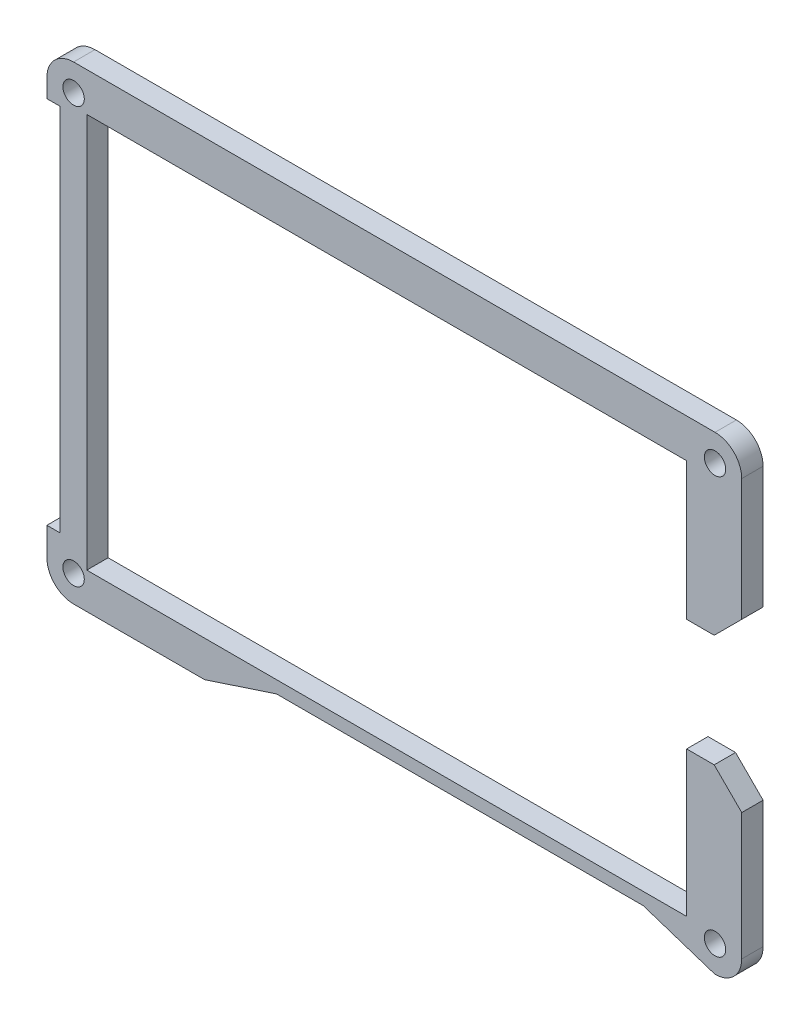
ISO-10303-21;
HEADER;
FILE_DESCRIPTION(('STEP AP214'),'2;1');
FILE_NAME('part.step','',(''),(''),'','','');
FILE_SCHEMA(('AUTOMOTIVE_DESIGN { 1 0 10303 214 1 1 1 1 }'));
ENDSEC;
DATA;
#1=APPLICATION_CONTEXT('core data for automotive mechanical design processes');
#2=APPLICATION_PROTOCOL_DEFINITION('international standard','automotive_design',2000,#1);
#3=PRODUCT_CONTEXT('',#1,'mechanical');
#4=PRODUCT('Part','Part','',(#3));
#5=PRODUCT_RELATED_PRODUCT_CATEGORY('part','',(#4));
#6=PRODUCT_DEFINITION_FORMATION('','',#4);
#7=PRODUCT_DEFINITION_CONTEXT('part definition',#1,'design');
#8=PRODUCT_DEFINITION('design','',#6,#7);
#9=PRODUCT_DEFINITION_SHAPE('','',#8);
#10=(LENGTH_UNIT() NAMED_UNIT(*) SI_UNIT(.MILLI.,.METRE.));
#11=(NAMED_UNIT(*) PLANE_ANGLE_UNIT() SI_UNIT($,.RADIAN.));
#12=(NAMED_UNIT(*) SI_UNIT($,.STERADIAN.) SOLID_ANGLE_UNIT());
#13=UNCERTAINTY_MEASURE_WITH_UNIT(LENGTH_MEASURE(1.E-05),#10,'distance_accuracy_value','');
#14=(GEOMETRIC_REPRESENTATION_CONTEXT(3) GLOBAL_UNCERTAINTY_ASSIGNED_CONTEXT((#13)) GLOBAL_UNIT_ASSIGNED_CONTEXT((#10,
#11,#12)) REPRESENTATION_CONTEXT('',''));
#15=CARTESIAN_POINT('',(0.,0.,0.));
#16=DIRECTION('',(0.,0.,1.));
#17=DIRECTION('',(1.,0.,0.));
#18=AXIS2_PLACEMENT_3D('',#15,#16,#17);
#19=CARTESIAN_POINT('',(-301.9473,0.,3.048));
#20=DIRECTION('',(-1.,0.,0.));
#21=DIRECTION('',(0.,0.,1.));
#22=AXIS2_PLACEMENT_3D('',#19,#20,#21);
#23=PLANE('',#22);
#24=DIRECTION('',(0.,0.,1.));
#25=VECTOR('',#24,1.);
#26=CARTESIAN_POINT('',(-301.9473,133.57775,0.));
#27=LINE('',#26,#25);
#28=CARTESIAN_POINT('',(-301.9473,133.57775,0.));
#29=VERTEX_POINT('',#28);
#30=CARTESIAN_POINT('',(-301.9473,133.57775,3.048));
#31=VERTEX_POINT('',#30);
#32=EDGE_CURVE('E238',#29,#31,#27,.T.);
#33=ORIENTED_EDGE('',*,*,#32,.F.);
#34=DIRECTION('',(0.,1.,0.));
#35=VECTOR('',#34,1.);
#36=CARTESIAN_POINT('',(-301.9473,0.,0.));
#37=LINE('',#36,#35);
#38=CARTESIAN_POINT('',(-301.9473,150.9704,0.));
#39=VERTEX_POINT('',#38);
#40=EDGE_CURVE('E264',#29,#39,#37,.T.);
#41=ORIENTED_EDGE('',*,*,#40,.T.);
#42=DIRECTION('',(0.,0.,-1.));
#43=VECTOR('',#42,1.);
#44=CARTESIAN_POINT('',(-301.9473,150.9704,3.048));
#45=LINE('',#44,#43);
#46=CARTESIAN_POINT('',(-301.9473,150.9704,3.048));
#47=VERTEX_POINT('',#46);
#48=EDGE_CURVE('E11',#47,#39,#45,.T.);
#49=ORIENTED_EDGE('',*,*,#48,.F.);
#50=DIRECTION('',(0.,1.,0.));
#51=VECTOR('',#50,1.);
#52=CARTESIAN_POINT('',(-301.9473,0.,3.048));
#53=LINE('',#52,#51);
#54=EDGE_CURVE('E267',#31,#47,#53,.T.);
#55=ORIENTED_EDGE('',*,*,#54,.F.);
#56=EDGE_LOOP('',(#33,#41,#49,#55));
#57=FACE_BOUND('',#56,.T.);
#58=ADVANCED_FACE('F34',(#57),#23,.F.);
#59=CARTESIAN_POINT('',(-309.8086,0.,3.048));
#60=DIRECTION('',(1.,0.,0.));
#61=DIRECTION('',(0.,0.,-1.));
#62=AXIS2_PLACEMENT_3D('',#59,#60,#61);
#63=PLANE('',#62);
#64=DIRECTION('',(0.,0.,1.));
#65=VECTOR('',#64,1.);
#66=CARTESIAN_POINT('',(-309.8086,129.6471,0.));
#67=LINE('',#66,#65);
#68=CARTESIAN_POINT('',(-309.8086,129.6471,0.));
#69=VERTEX_POINT('',#68);
#70=CARTESIAN_POINT('',(-309.8086,129.6471,3.048));
#71=VERTEX_POINT('',#70);
#72=EDGE_CURVE('E56',#69,#71,#67,.T.);
#73=ORIENTED_EDGE('',*,*,#72,.T.);
#74=DIRECTION('',(0.,-1.,0.));
#75=VECTOR('',#74,1.);
#76=CARTESIAN_POINT('',(-309.8086,0.,3.048));
#77=LINE('',#76,#75);
#78=CARTESIAN_POINT('',(-309.8086,149.2432,3.048));
#79=VERTEX_POINT('',#78);
#80=EDGE_CURVE('E313',#79,#71,#77,.T.);
#81=ORIENTED_EDGE('',*,*,#80,.F.);
#82=DIRECTION('',(0.,0.,-1.));
#83=VECTOR('',#82,1.);
#84=CARTESIAN_POINT('',(-309.8086,149.2432,3.048));
#85=LINE('',#84,#83);
#86=CARTESIAN_POINT('',(-309.8086,149.2432,0.));
#87=VERTEX_POINT('',#86);
#88=EDGE_CURVE('E316',#79,#87,#85,.T.);
#89=ORIENTED_EDGE('',*,*,#88,.T.);
#90=DIRECTION('',(0.,-1.,0.));
#91=VECTOR('',#90,1.);
#92=CARTESIAN_POINT('',(-309.8086,0.,0.));
#93=LINE('',#92,#91);
#94=EDGE_CURVE('E270',#87,#69,#93,.T.);
#95=ORIENTED_EDGE('',*,*,#94,.T.);
#96=EDGE_LOOP('',(#73,#81,#89,#95));
#97=FACE_BOUND('',#96,.T.);
#98=ADVANCED_FACE('F446',(#97),#63,.F.);
#99=CARTESIAN_POINT('',(0.,0.,3.048));
#100=DIRECTION('',(0.,0.,1.));
#101=DIRECTION('',(1.,0.,0.));
#102=AXIS2_PLACEMENT_3D('',#99,#100,#101);
#103=PLANE('',#102);
#104=DIRECTION('',(1.,0.,0.));
#105=VECTOR('',#104,1.);
#106=CARTESIAN_POINT('',(0.,113.6451,3.048));
#107=LINE('',#106,#105);
#108=CARTESIAN_POINT('',(-309.8086,113.6451,3.048));
#109=VERTEX_POINT('',#108);
#110=CARTESIAN_POINT('',(-305.87795,113.6451,3.048));
#111=VERTEX_POINT('',#110);
#112=EDGE_CURVE('E202',#109,#111,#107,.T.);
#113=ORIENTED_EDGE('',*,*,#112,.F.);
#114=DIRECTION('',(0.,-1.,0.));
#115=VECTOR('',#114,1.);
#116=CARTESIAN_POINT('',(-309.8086,0.,3.048));
#117=LINE('',#116,#115);
#118=CARTESIAN_POINT('',(-309.8086,92.9525,3.048));
#119=VERTEX_POINT('',#118);
#120=EDGE_CURVE('E304',#109,#119,#117,.T.);
#121=ORIENTED_EDGE('',*,*,#120,.T.);
#122=DIRECTION('',(1.,0.,0.));
#123=VECTOR('',#122,1.);
#124=CARTESIAN_POINT('',(0.,92.9525,3.048));
#125=LINE('',#124,#123);
#126=CARTESIAN_POINT('',(-395.3675,92.9525,3.048));
#127=VERTEX_POINT('',#126);
#128=EDGE_CURVE('E306',#127,#119,#125,.T.);
#129=ORIENTED_EDGE('',*,*,#128,.F.);
#130=DIRECTION('',(0.,1.,0.));
#131=VECTOR('',#130,1.);
#132=CARTESIAN_POINT('',(-395.3675,0.,3.048));
#133=LINE('',#132,#131);
#134=CARTESIAN_POINT('',(-395.3675,149.2432,3.048));
#135=VERTEX_POINT('',#134);
#136=EDGE_CURVE('E309',#127,#135,#133,.T.);
#137=ORIENTED_EDGE('',*,*,#136,.T.);
#138=DIRECTION('',(1.,0.,0.));
#139=VECTOR('',#138,1.);
#140=CARTESIAN_POINT('',(0.,149.2432,3.048));
#141=LINE('',#140,#139);
#142=EDGE_CURVE('E311',#135,#79,#141,.T.);
#143=ORIENTED_EDGE('',*,*,#142,.T.);
#144=ORIENTED_EDGE('',*,*,#80,.T.);
#145=DIRECTION('',(1.,0.,0.));
#146=VECTOR('',#145,1.);
#147=CARTESIAN_POINT('',(0.,129.6471,3.048));
#148=LINE('',#147,#146);
#149=CARTESIAN_POINT('',(-305.87795,129.6471,3.048));
#150=VERTEX_POINT('',#149);
#151=EDGE_CURVE('E231',#71,#150,#148,.T.);
#152=ORIENTED_EDGE('',*,*,#151,.T.);
#153=DIRECTION('',(0.707106781186545,0.70710678118655,0.));
#154=VECTOR('',#153,1.);
#155=CARTESIAN_POINT('',(-217.762525000001,217.762524999999,3.048));
#156=LINE('',#155,#154);
#157=EDGE_CURVE('E226',#150,#31,#156,.T.);
#158=ORIENTED_EDGE('',*,*,#157,.T.);
#159=ORIENTED_EDGE('',*,*,#54,.T.);
#160=CARTESIAN_POINT('',(-305.7573,150.9704,3.048));
#161=DIRECTION('',(0.,0.,1.));
#162=DIRECTION('',(1.,0.,0.));
#163=AXIS2_PLACEMENT_3D('',#160,#161,#162);
#164=CIRCLE('',#163,3.80999999999997);
#165=CARTESIAN_POINT('',(-305.7573,154.7804,3.048));
#166=VERTEX_POINT('',#165);
#167=EDGE_CURVE('E269',#47,#166,#164,.T.);
#168=ORIENTED_EDGE('',*,*,#167,.T.);
#169=DIRECTION('',(-1.,0.,0.));
#170=VECTOR('',#169,1.);
#171=CARTESIAN_POINT('',(0.,154.7804,3.048));
#172=LINE('',#171,#170);
#173=CARTESIAN_POINT('',(-397.247125,154.7804,3.048));
#174=VERTEX_POINT('',#173);
#175=EDGE_CURVE('E272',#166,#174,#172,.T.);
#176=ORIENTED_EDGE('',*,*,#175,.T.);
#177=CARTESIAN_POINT('',(-397.247125,150.9704,3.048));
#178=DIRECTION('',(0.,0.,1.));
#179=DIRECTION('',(1.,0.,0.));
#180=AXIS2_PLACEMENT_3D('',#177,#178,#179);
#181=CIRCLE('',#180,3.81000000000001);
#182=CARTESIAN_POINT('',(-401.0571,150.956597848903,3.048));
#183=VERTEX_POINT('',#182);
#184=EDGE_CURVE('E274',#174,#183,#181,.T.);
#185=ORIENTED_EDGE('',*,*,#184,.T.);
#186=DIRECTION('',(0.,-1.,0.));
#187=VECTOR('',#186,1.);
#188=CARTESIAN_POINT('',(-401.0571,0.,3.048));
#189=LINE('',#188,#187);
#190=CARTESIAN_POINT('',(-401.0571,148.341,3.048));
#191=VERTEX_POINT('',#190);
#192=EDGE_CURVE('E276',#183,#191,#189,.T.);
#193=ORIENTED_EDGE('',*,*,#192,.T.);
#194=DIRECTION('',(1.,0.,0.));
#195=VECTOR('',#194,1.);
#196=CARTESIAN_POINT('',(0.,148.341,3.048));
#197=LINE('',#196,#195);
#198=CARTESIAN_POINT('',(-399.1521,148.341,3.048));
#199=VERTEX_POINT('',#198);
#200=EDGE_CURVE('E278',#191,#199,#197,.T.);
#201=ORIENTED_EDGE('',*,*,#200,.T.);
#202=DIRECTION('',(0.,-1.,0.));
#203=VECTOR('',#202,1.);
#204=CARTESIAN_POINT('',(-399.1521,0.,3.048));
#205=LINE('',#204,#203);
#206=CARTESIAN_POINT('',(-399.1521,95.6449,3.048));
#207=VERTEX_POINT('',#206);
#208=EDGE_CURVE('E280',#199,#207,#205,.T.);
#209=ORIENTED_EDGE('',*,*,#208,.T.);
#210=DIRECTION('',(-1.,0.,0.));
#211=VECTOR('',#210,1.);
#212=CARTESIAN_POINT('',(0.,95.6449,3.048));
#213=LINE('',#212,#211);
#214=CARTESIAN_POINT('',(-401.0571,95.6449,3.048));
#215=VERTEX_POINT('',#214);
#216=EDGE_CURVE('E282',#207,#215,#213,.T.);
#217=ORIENTED_EDGE('',*,*,#216,.T.);
#218=DIRECTION('',(0.,-1.,0.));
#219=VECTOR('',#218,1.);
#220=CARTESIAN_POINT('',(-401.0571,0.,3.048));
#221=LINE('',#220,#219);
#222=CARTESIAN_POINT('',(-401.0571,91.6593041663556,3.048));
#223=VERTEX_POINT('',#222);
#224=EDGE_CURVE('E284',#215,#223,#221,.T.);
#225=ORIENTED_EDGE('',*,*,#224,.T.);
#226=CARTESIAN_POINT('',(-397.2472,91.6317,3.048));
#227=DIRECTION('',(0.,0.,1.));
#228=DIRECTION('',(1.,0.,0.));
#229=AXIS2_PLACEMENT_3D('',#226,#227,#228);
#230=CIRCLE('',#229,3.81);
#231=CARTESIAN_POINT('',(-397.2472,87.8217,3.048));
#232=VERTEX_POINT('',#231);
#233=EDGE_CURVE('E286',#223,#232,#230,.T.);
#234=ORIENTED_EDGE('',*,*,#233,.T.);
#235=DIRECTION('',(-1.,0.,0.));
#236=VECTOR('',#235,1.);
#237=CARTESIAN_POINT('',(0.,87.8217,3.048));
#238=LINE('',#237,#236);
#239=CARTESIAN_POINT('',(-378.5565,87.8217,3.048));
#240=VERTEX_POINT('',#239);
#241=EDGE_CURVE('E288',#240,#232,#238,.T.);
#242=ORIENTED_EDGE('',*,*,#241,.F.);
#243=DIRECTION('',(-0.949975924247208,-0.312323139313538,0.));
#244=VECTOR('',#243,1.);
#245=CARTESIAN_POINT('',(-62.9832264166032,191.572577231041,3.048));
#246=LINE('',#245,#244);
#247=CARTESIAN_POINT('',(-368.3165,91.1883,3.048));
#248=VERTEX_POINT('',#247);
#249=EDGE_CURVE('E291',#248,#240,#246,.T.);
#250=ORIENTED_EDGE('',*,*,#249,.F.);
#251=DIRECTION('',(-1.,0.,0.));
#252=VECTOR('',#251,1.);
#253=CARTESIAN_POINT('',(0.,91.1883000000002,3.048));
#254=LINE('',#253,#252);
#255=CARTESIAN_POINT('',(-315.9973,91.1883,3.048));
#256=VERTEX_POINT('',#255);
#257=EDGE_CURVE('E294',#256,#248,#254,.T.);
#258=ORIENTED_EDGE('',*,*,#257,.F.);
#259=DIRECTION('',(0.949975924247207,-0.312323139313541,0.));
#260=VECTOR('',#259,1.);
#261=CARTESIAN_POINT('',(-3.76867188951447,-11.4629597067154,3.048));
#262=LINE('',#261,#260);
#263=CARTESIAN_POINT('',(-305.7573,87.8217,3.048));
#264=VERTEX_POINT('',#263);
#265=EDGE_CURVE('E297',#256,#264,#262,.T.);
#266=ORIENTED_EDGE('',*,*,#265,.T.);
#267=CARTESIAN_POINT('',(-305.7573,91.6317,3.048));
#268=DIRECTION('',(0.,0.,1.));
#269=DIRECTION('',(1.,0.,0.));
#270=AXIS2_PLACEMENT_3D('',#267,#268,#269);
#271=CIRCLE('',#270,3.80999999999997);
#272=CARTESIAN_POINT('',(-301.9473,91.6317,3.048));
#273=VERTEX_POINT('',#272);
#274=EDGE_CURVE('E299',#264,#273,#271,.T.);
#275=ORIENTED_EDGE('',*,*,#274,.T.);
#276=DIRECTION('',(0.,1.,0.));
#277=VECTOR('',#276,1.);
#278=CARTESIAN_POINT('',(-301.9473,0.,3.048));
#279=LINE('',#278,#277);
#280=CARTESIAN_POINT('',(-301.9473,109.71445,3.048));
#281=VERTEX_POINT('',#280);
#282=EDGE_CURVE('E301',#273,#281,#279,.T.);
#283=ORIENTED_EDGE('',*,*,#282,.T.);
#284=DIRECTION('',(0.70710678118655,-0.707106781186545,0.));
#285=VECTOR('',#284,1.);
#286=CARTESIAN_POINT('',(-96.1164249999989,-96.1164249999996,3.048));
#287=LINE('',#286,#285);
#288=EDGE_CURVE('E219',#111,#281,#287,.T.);
#289=ORIENTED_EDGE('',*,*,#288,.F.);
#290=EDGE_LOOP('',(#113,#121,#129,#137,#143,#144,#152,#158,#159,#168,#176,#185,#193,#201,#209,
#217,#225,#234,#242,#250,#258,#266,#275,#283,#289));
#291=FACE_BOUND('',#290,.T.);
#292=CARTESIAN_POINT('',(-305.7573,150.9704,3.048));
#293=DIRECTION('',(0.,0.,-1.));
#294=DIRECTION('',(-1.,0.,0.));
#295=AXIS2_PLACEMENT_3D('',#292,#293,#294);
#296=CIRCLE('',#295,1.52400000000001);
#297=CARTESIAN_POINT('',(-307.2813,150.9704,3.048));
#298=VERTEX_POINT('',#297);
#299=EDGE_CURVE('E261',#298,#298,#296,.T.);
#300=ORIENTED_EDGE('',*,*,#299,.T.);
#301=EDGE_LOOP('',(#300));
#302=FACE_BOUND('',#301,.T.);
#303=CARTESIAN_POINT('',(-305.7573,91.6317,3.048));
#304=DIRECTION('',(0.,0.,-1.));
#305=DIRECTION('',(-1.,0.,0.));
#306=AXIS2_PLACEMENT_3D('',#303,#304,#305);
#307=CIRCLE('',#306,1.52400000000001);
#308=CARTESIAN_POINT('',(-307.2813,91.6317,3.048));
#309=VERTEX_POINT('',#308);
#310=EDGE_CURVE('E255',#309,#309,#307,.T.);
#311=ORIENTED_EDGE('',*,*,#310,.T.);
#312=EDGE_LOOP('',(#311));
#313=FACE_BOUND('',#312,.T.);
#314=CARTESIAN_POINT('',(-397.2472,91.6317,3.048));
#315=DIRECTION('',(0.,0.,-1.));
#316=DIRECTION('',(-1.,0.,0.));
#317=AXIS2_PLACEMENT_3D('',#314,#315,#316);
#318=CIRCLE('',#317,1.52400000000001);
#319=CARTESIAN_POINT('',(-398.7712,91.6317,3.048));
#320=VERTEX_POINT('',#319);
#321=EDGE_CURVE('E249',#320,#320,#318,.T.);
#322=ORIENTED_EDGE('',*,*,#321,.T.);
#323=EDGE_LOOP('',(#322));
#324=FACE_BOUND('',#323,.T.);
#325=CARTESIAN_POINT('',(-397.247125,150.9704,3.048));
#326=DIRECTION('',(0.,0.,-1.));
#327=DIRECTION('',(-1.,0.,0.));
#328=AXIS2_PLACEMENT_3D('',#325,#326,#327);
#329=CIRCLE('',#328,1.52400000000001);
#330=CARTESIAN_POINT('',(-398.771125,150.9704,3.048));
#331=VERTEX_POINT('',#330);
#332=EDGE_CURVE('E243',#331,#331,#329,.T.);
#333=ORIENTED_EDGE('',*,*,#332,.T.);
#334=EDGE_LOOP('',(#333));
#335=FACE_BOUND('',#334,.T.);
#336=ADVANCED_FACE('F429',(#291,#302,#313,#324,#335),#103,.T.);
#337=CARTESIAN_POINT('',(0.,0.,0.));
#338=DIRECTION('',(0.,0.,1.));
#339=DIRECTION('',(1.,0.,0.));
#340=AXIS2_PLACEMENT_3D('',#337,#338,#339);
#341=PLANE('',#340);
#342=CARTESIAN_POINT('',(-305.7573,150.9704,0.));
#343=DIRECTION('',(0.,0.,-1.));
#344=DIRECTION('',(-1.,0.,0.));
#345=AXIS2_PLACEMENT_3D('',#342,#343,#344);
#346=CIRCLE('',#345,1.52400000000001);
#347=CARTESIAN_POINT('',(-307.2813,150.9704,0.));
#348=VERTEX_POINT('',#347);
#349=EDGE_CURVE('E258',#348,#348,#346,.T.);
#350=ORIENTED_EDGE('',*,*,#349,.F.);
#351=EDGE_LOOP('',(#350));
#352=FACE_BOUND('',#351,.T.);
#353=CARTESIAN_POINT('',(-305.7573,91.6317,0.));
#354=DIRECTION('',(0.,0.,-1.));
#355=DIRECTION('',(-1.,0.,0.));
#356=AXIS2_PLACEMENT_3D('',#353,#354,#355);
#357=CIRCLE('',#356,1.52400000000001);
#358=CARTESIAN_POINT('',(-307.2813,91.6317,0.));
#359=VERTEX_POINT('',#358);
#360=EDGE_CURVE('E252',#359,#359,#357,.T.);
#361=ORIENTED_EDGE('',*,*,#360,.F.);
#362=EDGE_LOOP('',(#361));
#363=FACE_BOUND('',#362,.T.);
#364=CARTESIAN_POINT('',(-397.2472,91.6317,0.));
#365=DIRECTION('',(0.,0.,-1.));
#366=DIRECTION('',(-1.,0.,0.));
#367=AXIS2_PLACEMENT_3D('',#364,#365,#366);
#368=CIRCLE('',#367,1.52400000000001);
#369=CARTESIAN_POINT('',(-398.7712,91.6317,0.));
#370=VERTEX_POINT('',#369);
#371=EDGE_CURVE('E246',#370,#370,#368,.T.);
#372=ORIENTED_EDGE('',*,*,#371,.F.);
#373=EDGE_LOOP('',(#372));
#374=FACE_BOUND('',#373,.T.);
#375=CARTESIAN_POINT('',(-397.247125,150.9704,0.));
#376=DIRECTION('',(0.,0.,-1.));
#377=DIRECTION('',(-1.,0.,0.));
#378=AXIS2_PLACEMENT_3D('',#375,#376,#377);
#379=CIRCLE('',#378,1.52400000000001);
#380=CARTESIAN_POINT('',(-398.771125,150.9704,0.));
#381=VERTEX_POINT('',#380);
#382=EDGE_CURVE('E240',#381,#381,#379,.T.);
#383=ORIENTED_EDGE('',*,*,#382,.F.);
#384=EDGE_LOOP('',(#383));
#385=FACE_BOUND('',#384,.T.);
#386=DIRECTION('',(0.,-1.,0.));
#387=VECTOR('',#386,1.);
#388=CARTESIAN_POINT('',(-309.8086,0.,0.));
#389=LINE('',#388,#387);
#390=CARTESIAN_POINT('',(-309.8086,113.6451,0.));
#391=VERTEX_POINT('',#390);
#392=CARTESIAN_POINT('',(-309.8086,92.9525,0.));
#393=VERTEX_POINT('',#392);
#394=EDGE_CURVE('E218',#391,#393,#389,.T.);
#395=ORIENTED_EDGE('',*,*,#394,.F.);
#396=DIRECTION('',(1.,0.,0.));
#397=VECTOR('',#396,1.);
#398=CARTESIAN_POINT('',(0.,113.6451,0.));
#399=LINE('',#398,#397);
#400=CARTESIAN_POINT('',(-305.87795,113.6451,0.));
#401=VERTEX_POINT('',#400);
#402=EDGE_CURVE('E48',#391,#401,#399,.T.);
#403=ORIENTED_EDGE('',*,*,#402,.T.);
#404=DIRECTION('',(0.70710678118655,-0.707106781186545,0.));
#405=VECTOR('',#404,1.);
#406=CARTESIAN_POINT('',(-96.1164249999989,-96.1164249999996,0.));
#407=LINE('',#406,#405);
#408=CARTESIAN_POINT('',(-301.9473,109.71445,0.));
#409=VERTEX_POINT('',#408);
#410=EDGE_CURVE('E206',#401,#409,#407,.T.);
#411=ORIENTED_EDGE('',*,*,#410,.T.);
#412=DIRECTION('',(0.,1.,0.));
#413=VECTOR('',#412,1.);
#414=CARTESIAN_POINT('',(-301.9473,0.,0.));
#415=LINE('',#414,#413);
#416=CARTESIAN_POINT('',(-301.9473,91.6317,0.));
#417=VERTEX_POINT('',#416);
#418=EDGE_CURVE('E350',#417,#409,#415,.T.);
#419=ORIENTED_EDGE('',*,*,#418,.F.);
#420=CARTESIAN_POINT('',(-305.7573,91.6317,0.));
#421=DIRECTION('',(0.,0.,1.));
#422=DIRECTION('',(1.,0.,0.));
#423=AXIS2_PLACEMENT_3D('',#420,#421,#422);
#424=CIRCLE('',#423,3.80999999999997);
#425=CARTESIAN_POINT('',(-305.7573,87.8217,0.));
#426=VERTEX_POINT('',#425);
#427=EDGE_CURVE('E348',#426,#417,#424,.T.);
#428=ORIENTED_EDGE('',*,*,#427,.F.);
#429=DIRECTION('',(0.949975924247207,-0.312323139313541,0.));
#430=VECTOR('',#429,1.);
#431=CARTESIAN_POINT('',(-3.76867188951447,-11.4629597067154,0.));
#432=LINE('',#431,#430);
#433=CARTESIAN_POINT('',(-315.9973,91.1883,0.));
#434=VERTEX_POINT('',#433);
#435=EDGE_CURVE('E346',#434,#426,#432,.T.);
#436=ORIENTED_EDGE('',*,*,#435,.F.);
#437=DIRECTION('',(-1.,0.,0.));
#438=VECTOR('',#437,1.);
#439=CARTESIAN_POINT('',(0.,91.1883000000002,0.));
#440=LINE('',#439,#438);
#441=CARTESIAN_POINT('',(-368.3165,91.1883,0.));
#442=VERTEX_POINT('',#441);
#443=EDGE_CURVE('E343',#434,#442,#440,.T.);
#444=ORIENTED_EDGE('',*,*,#443,.T.);
#445=DIRECTION('',(-0.949975924247208,-0.312323139313538,0.));
#446=VECTOR('',#445,1.);
#447=CARTESIAN_POINT('',(-62.9832264166032,191.572577231041,0.));
#448=LINE('',#447,#446);
#449=CARTESIAN_POINT('',(-378.5565,87.8217,0.));
#450=VERTEX_POINT('',#449);
#451=EDGE_CURVE('E340',#442,#450,#448,.T.);
#452=ORIENTED_EDGE('',*,*,#451,.T.);
#453=DIRECTION('',(-1.,0.,0.));
#454=VECTOR('',#453,1.);
#455=CARTESIAN_POINT('',(0.,87.8217,0.));
#456=LINE('',#455,#454);
#457=CARTESIAN_POINT('',(-397.2472,87.8217,0.));
#458=VERTEX_POINT('',#457);
#459=EDGE_CURVE('E337',#450,#458,#456,.T.);
#460=ORIENTED_EDGE('',*,*,#459,.T.);
#461=CARTESIAN_POINT('',(-397.2472,91.6317,0.));
#462=DIRECTION('',(0.,0.,1.));
#463=DIRECTION('',(1.,0.,0.));
#464=AXIS2_PLACEMENT_3D('',#461,#462,#463);
#465=CIRCLE('',#464,3.81);
#466=CARTESIAN_POINT('',(-401.0571,91.6593041663556,0.));
#467=VERTEX_POINT('',#466);
#468=EDGE_CURVE('E334',#467,#458,#465,.T.);
#469=ORIENTED_EDGE('',*,*,#468,.F.);
#470=DIRECTION('',(0.,-1.,0.));
#471=VECTOR('',#470,1.);
#472=CARTESIAN_POINT('',(-401.0571,0.,0.));
#473=LINE('',#472,#471);
#474=CARTESIAN_POINT('',(-401.0571,95.6449,0.));
#475=VERTEX_POINT('',#474);
#476=EDGE_CURVE('E332',#475,#467,#473,.T.);
#477=ORIENTED_EDGE('',*,*,#476,.F.);
#478=DIRECTION('',(-1.,0.,0.));
#479=VECTOR('',#478,1.);
#480=CARTESIAN_POINT('',(0.,95.6449,0.));
#481=LINE('',#480,#479);
#482=CARTESIAN_POINT('',(-399.1521,95.6449,0.));
#483=VERTEX_POINT('',#482);
#484=EDGE_CURVE('E330',#483,#475,#481,.T.);
#485=ORIENTED_EDGE('',*,*,#484,.F.);
#486=DIRECTION('',(0.,-1.,0.));
#487=VECTOR('',#486,1.);
#488=CARTESIAN_POINT('',(-399.1521,0.,0.));
#489=LINE('',#488,#487);
#490=CARTESIAN_POINT('',(-399.1521,148.341,0.));
#491=VERTEX_POINT('',#490);
#492=EDGE_CURVE('E328',#491,#483,#489,.T.);
#493=ORIENTED_EDGE('',*,*,#492,.F.);
#494=DIRECTION('',(1.,0.,0.));
#495=VECTOR('',#494,1.);
#496=CARTESIAN_POINT('',(0.,148.341,0.));
#497=LINE('',#496,#495);
#498=CARTESIAN_POINT('',(-401.0571,148.341,0.));
#499=VERTEX_POINT('',#498);
#500=EDGE_CURVE('E326',#499,#491,#497,.T.);
#501=ORIENTED_EDGE('',*,*,#500,.F.);
#502=DIRECTION('',(0.,-1.,0.));
#503=VECTOR('',#502,1.);
#504=CARTESIAN_POINT('',(-401.0571,0.,0.));
#505=LINE('',#504,#503);
#506=CARTESIAN_POINT('',(-401.0571,150.956597848903,0.));
#507=VERTEX_POINT('',#506);
#508=EDGE_CURVE('E324',#507,#499,#505,.T.);
#509=ORIENTED_EDGE('',*,*,#508,.F.);
#510=CARTESIAN_POINT('',(-397.247125,150.9704,0.));
#511=DIRECTION('',(0.,0.,1.));
#512=DIRECTION('',(1.,0.,0.));
#513=AXIS2_PLACEMENT_3D('',#510,#511,#512);
#514=CIRCLE('',#513,3.81000000000001);
#515=CARTESIAN_POINT('',(-397.247125,154.7804,0.));
#516=VERTEX_POINT('',#515);
#517=EDGE_CURVE('E322',#516,#507,#514,.T.);
#518=ORIENTED_EDGE('',*,*,#517,.F.);
#519=DIRECTION('',(-1.,0.,0.));
#520=VECTOR('',#519,1.);
#521=CARTESIAN_POINT('',(0.,154.7804,0.));
#522=LINE('',#521,#520);
#523=CARTESIAN_POINT('',(-305.7573,154.7804,0.));
#524=VERTEX_POINT('',#523);
#525=EDGE_CURVE('E320',#524,#516,#522,.T.);
#526=ORIENTED_EDGE('',*,*,#525,.F.);
#527=CARTESIAN_POINT('',(-305.7573,150.9704,0.));
#528=DIRECTION('',(0.,0.,1.));
#529=DIRECTION('',(1.,0.,0.));
#530=AXIS2_PLACEMENT_3D('',#527,#528,#529);
#531=CIRCLE('',#530,3.80999999999997);
#532=EDGE_CURVE('E318',#39,#524,#531,.T.);
#533=ORIENTED_EDGE('',*,*,#532,.F.);
#534=ORIENTED_EDGE('',*,*,#40,.F.);
#535=DIRECTION('',(0.707106781186545,0.70710678118655,0.));
#536=VECTOR('',#535,1.);
#537=CARTESIAN_POINT('',(-217.762525000001,217.762524999999,0.));
#538=LINE('',#537,#536);
#539=CARTESIAN_POINT('',(-305.87795,129.6471,0.));
#540=VERTEX_POINT('',#539);
#541=EDGE_CURVE('E228',#540,#29,#538,.T.);
#542=ORIENTED_EDGE('',*,*,#541,.F.);
#543=DIRECTION('',(1.,0.,0.));
#544=VECTOR('',#543,1.);
#545=CARTESIAN_POINT('',(0.,129.6471,0.));
#546=LINE('',#545,#544);
#547=EDGE_CURVE('E230',#69,#540,#546,.T.);
#548=ORIENTED_EDGE('',*,*,#547,.F.);
#549=ORIENTED_EDGE('',*,*,#94,.F.);
#550=DIRECTION('',(1.,0.,0.));
#551=VECTOR('',#550,1.);
#552=CARTESIAN_POINT('',(0.,149.2432,0.));
#553=LINE('',#552,#551);
#554=CARTESIAN_POINT('',(-395.3675,149.2432,0.));
#555=VERTEX_POINT('',#554);
#556=EDGE_CURVE('E357',#555,#87,#553,.T.);
#557=ORIENTED_EDGE('',*,*,#556,.F.);
#558=DIRECTION('',(0.,1.,0.));
#559=VECTOR('',#558,1.);
#560=CARTESIAN_POINT('',(-395.3675,0.,0.));
#561=LINE('',#560,#559);
#562=CARTESIAN_POINT('',(-395.3675,92.9525,0.));
#563=VERTEX_POINT('',#562);
#564=EDGE_CURVE('E355',#563,#555,#561,.T.);
#565=ORIENTED_EDGE('',*,*,#564,.F.);
#566=DIRECTION('',(1.,0.,0.));
#567=VECTOR('',#566,1.);
#568=CARTESIAN_POINT('',(0.,92.9525,0.));
#569=LINE('',#568,#567);
#570=EDGE_CURVE('E353',#563,#393,#569,.T.);
#571=ORIENTED_EDGE('',*,*,#570,.T.);
#572=EDGE_LOOP('',(#395,#403,#411,#419,#428,#436,#444,#452,#460,#469,#477,#485,#493,#501,#509,
#518,#526,#533,#534,#542,#548,#549,#557,#565,#571));
#573=FACE_BOUND('',#572,.T.);
#574=ADVANCED_FACE('F216',(#352,#363,#374,#385,#573),#341,.F.);
#575=CARTESIAN_POINT('',(-305.7573,150.9704,3.048));
#576=DIRECTION('',(0.,0.,-1.));
#577=DIRECTION('',(-1.,0.,0.));
#578=AXIS2_PLACEMENT_3D('',#575,#576,#577);
#579=CYLINDRICAL_SURFACE('',#578,3.80999999999997);
#580=ORIENTED_EDGE('',*,*,#532,.T.);
#581=DIRECTION('',(0.,0.,-1.));
#582=VECTOR('',#581,1.);
#583=CARTESIAN_POINT('',(-305.7573,154.7804,3.048));
#584=LINE('',#583,#582);
#585=EDGE_CURVE('E41',#166,#524,#584,.T.);
#586=ORIENTED_EDGE('',*,*,#585,.F.);
#587=ORIENTED_EDGE('',*,*,#167,.F.);
#588=ORIENTED_EDGE('',*,*,#48,.T.);
#589=EDGE_LOOP('',(#580,#586,#587,#588));
#590=FACE_BOUND('',#589,.T.);
#591=ADVANCED_FACE('F434',(#590),#579,.T.);
#592=CARTESIAN_POINT('',(0.,154.7804,3.048));
#593=DIRECTION('',(0.,-1.,0.));
#594=DIRECTION('',(0.,0.,-1.));
#595=AXIS2_PLACEMENT_3D('',#592,#593,#594);
#596=PLANE('',#595);
#597=ORIENTED_EDGE('',*,*,#525,.T.);
#598=DIRECTION('',(0.,0.,-1.));
#599=VECTOR('',#598,1.);
#600=CARTESIAN_POINT('',(-397.247125,154.7804,3.048));
#601=LINE('',#600,#599);
#602=EDGE_CURVE('E403',#174,#516,#601,.T.);
#603=ORIENTED_EDGE('',*,*,#602,.F.);
#604=ORIENTED_EDGE('',*,*,#175,.F.);
#605=ORIENTED_EDGE('',*,*,#585,.T.);
#606=EDGE_LOOP('',(#597,#603,#604,#605));
#607=FACE_BOUND('',#606,.T.);
#608=ADVANCED_FACE('F410',(#607),#596,.F.);
#609=CARTESIAN_POINT('',(-397.247125,150.9704,3.048));
#610=DIRECTION('',(0.,0.,-1.));
#611=DIRECTION('',(-1.,0.,0.));
#612=AXIS2_PLACEMENT_3D('',#609,#610,#611);
#613=CYLINDRICAL_SURFACE('',#612,3.81000000000001);
#614=ORIENTED_EDGE('',*,*,#517,.T.);
#615=DIRECTION('',(0.,0.,-1.));
#616=VECTOR('',#615,1.);
#617=CARTESIAN_POINT('',(-401.0571,150.956597848903,3.048));
#618=LINE('',#617,#616);
#619=EDGE_CURVE('E400',#183,#507,#618,.T.);
#620=ORIENTED_EDGE('',*,*,#619,.F.);
#621=ORIENTED_EDGE('',*,*,#184,.F.);
#622=ORIENTED_EDGE('',*,*,#602,.T.);
#623=EDGE_LOOP('',(#614,#620,#621,#622));
#624=FACE_BOUND('',#623,.T.);
#625=ADVANCED_FACE('F421',(#624),#613,.T.);
#626=CARTESIAN_POINT('',(-401.0571,0.,3.048));
#627=DIRECTION('',(1.,0.,0.));
#628=DIRECTION('',(0.,0.,-1.));
#629=AXIS2_PLACEMENT_3D('',#626,#627,#628);
#630=PLANE('',#629);
#631=ORIENTED_EDGE('',*,*,#508,.T.);
#632=DIRECTION('',(0.,0.,-1.));
#633=VECTOR('',#632,1.);
#634=CARTESIAN_POINT('',(-401.0571,148.341,3.048));
#635=LINE('',#634,#633);
#636=EDGE_CURVE('E397',#191,#499,#635,.T.);
#637=ORIENTED_EDGE('',*,*,#636,.F.);
#638=ORIENTED_EDGE('',*,*,#192,.F.);
#639=ORIENTED_EDGE('',*,*,#619,.T.);
#640=EDGE_LOOP('',(#631,#637,#638,#639));
#641=FACE_BOUND('',#640,.T.);
#642=ADVANCED_FACE('F425',(#641),#630,.F.);
#643=CARTESIAN_POINT('',(0.,148.341,3.048));
#644=DIRECTION('',(0.,1.,0.));
#645=DIRECTION('',(0.,0.,1.));
#646=AXIS2_PLACEMENT_3D('',#643,#644,#645);
#647=PLANE('',#646);
#648=ORIENTED_EDGE('',*,*,#500,.T.);
#649=DIRECTION('',(0.,0.,-1.));
#650=VECTOR('',#649,1.);
#651=CARTESIAN_POINT('',(-399.1521,148.341,3.048));
#652=LINE('',#651,#650);
#653=EDGE_CURVE('E394',#199,#491,#652,.T.);
#654=ORIENTED_EDGE('',*,*,#653,.F.);
#655=ORIENTED_EDGE('',*,*,#200,.F.);
#656=ORIENTED_EDGE('',*,*,#636,.T.);
#657=EDGE_LOOP('',(#648,#654,#655,#656));
#658=FACE_BOUND('',#657,.T.);
#659=ADVANCED_FACE('F510',(#658),#647,.F.);
#660=CARTESIAN_POINT('',(-399.1521,0.,3.048));
#661=DIRECTION('',(1.,0.,0.));
#662=DIRECTION('',(0.,0.,-1.));
#663=AXIS2_PLACEMENT_3D('',#660,#661,#662);
#664=PLANE('',#663);
#665=ORIENTED_EDGE('',*,*,#492,.T.);
#666=DIRECTION('',(0.,0.,-1.));
#667=VECTOR('',#666,1.);
#668=CARTESIAN_POINT('',(-399.1521,95.6449,3.048));
#669=LINE('',#668,#667);
#670=EDGE_CURVE('E391',#207,#483,#669,.T.);
#671=ORIENTED_EDGE('',*,*,#670,.F.);
#672=ORIENTED_EDGE('',*,*,#208,.F.);
#673=ORIENTED_EDGE('',*,*,#653,.T.);
#674=EDGE_LOOP('',(#665,#671,#672,#673));
#675=FACE_BOUND('',#674,.T.);
#676=ADVANCED_FACE('F508',(#675),#664,.F.);
#677=CARTESIAN_POINT('',(0.,95.6449,3.048));
#678=DIRECTION('',(0.,-1.,0.));
#679=DIRECTION('',(0.,0.,-1.));
#680=AXIS2_PLACEMENT_3D('',#677,#678,#679);
#681=PLANE('',#680);
#682=ORIENTED_EDGE('',*,*,#484,.T.);
#683=DIRECTION('',(0.,0.,-1.));
#684=VECTOR('',#683,1.);
#685=CARTESIAN_POINT('',(-401.0571,95.6449,3.048));
#686=LINE('',#685,#684);
#687=EDGE_CURVE('E388',#215,#475,#686,.T.);
#688=ORIENTED_EDGE('',*,*,#687,.F.);
#689=ORIENTED_EDGE('',*,*,#216,.F.);
#690=ORIENTED_EDGE('',*,*,#670,.T.);
#691=EDGE_LOOP('',(#682,#688,#689,#690));
#692=FACE_BOUND('',#691,.T.);
#693=ADVANCED_FACE('F504',(#692),#681,.F.);
#694=CARTESIAN_POINT('',(-401.0571,0.,3.048));
#695=DIRECTION('',(1.,0.,0.));
#696=DIRECTION('',(0.,0.,-1.));
#697=AXIS2_PLACEMENT_3D('',#694,#695,#696);
#698=PLANE('',#697);
#699=ORIENTED_EDGE('',*,*,#476,.T.);
#700=DIRECTION('',(0.,0.,-1.));
#701=VECTOR('',#700,1.);
#702=CARTESIAN_POINT('',(-401.0571,91.6593041663556,3.048));
#703=LINE('',#702,#701);
#704=EDGE_CURVE('E385',#223,#467,#703,.T.);
#705=ORIENTED_EDGE('',*,*,#704,.F.);
#706=ORIENTED_EDGE('',*,*,#224,.F.);
#707=ORIENTED_EDGE('',*,*,#687,.T.);
#708=EDGE_LOOP('',(#699,#705,#706,#707));
#709=FACE_BOUND('',#708,.T.);
#710=ADVANCED_FACE('F499',(#709),#698,.F.);
#711=CARTESIAN_POINT('',(-397.2472,91.6317,3.048));
#712=DIRECTION('',(0.,0.,-1.));
#713=DIRECTION('',(-1.,0.,0.));
#714=AXIS2_PLACEMENT_3D('',#711,#712,#713);
#715=CYLINDRICAL_SURFACE('',#714,3.81);
#716=ORIENTED_EDGE('',*,*,#468,.T.);
#717=DIRECTION('',(0.,0.,-1.));
#718=VECTOR('',#717,1.);
#719=CARTESIAN_POINT('',(-397.2472,87.8217,3.048));
#720=LINE('',#719,#718);
#721=EDGE_CURVE('E383',#232,#458,#720,.T.);
#722=ORIENTED_EDGE('',*,*,#721,.F.);
#723=ORIENTED_EDGE('',*,*,#233,.F.);
#724=ORIENTED_EDGE('',*,*,#704,.T.);
#725=EDGE_LOOP('',(#716,#722,#723,#724));
#726=FACE_BOUND('',#725,.T.);
#727=ADVANCED_FACE('F493',(#726),#715,.T.);
#728=CARTESIAN_POINT('',(0.,87.8217,3.048));
#729=DIRECTION('',(0.,-1.,0.));
#730=DIRECTION('',(0.,0.,-1.));
#731=AXIS2_PLACEMENT_3D('',#728,#729,#730);
#732=PLANE('',#731);
#733=ORIENTED_EDGE('',*,*,#459,.F.);
#734=DIRECTION('',(0.,0.,-1.));
#735=VECTOR('',#734,1.);
#736=CARTESIAN_POINT('',(-378.5565,87.8217,3.048));
#737=LINE('',#736,#735);
#738=EDGE_CURVE('E381',#240,#450,#737,.T.);
#739=ORIENTED_EDGE('',*,*,#738,.F.);
#740=ORIENTED_EDGE('',*,*,#241,.T.);
#741=ORIENTED_EDGE('',*,*,#721,.T.);
#742=EDGE_LOOP('',(#733,#739,#740,#741));
#743=FACE_BOUND('',#742,.T.);
#744=ADVANCED_FACE('F489',(#743),#732,.T.);
#745=CARTESIAN_POINT('',(-62.9832264166032,191.572577231041,3.048));
#746=DIRECTION('',(0.312323139313538,-0.949975924247208,0.));
#747=DIRECTION('',(0.949975924247208,0.312323139313538,0.));
#748=AXIS2_PLACEMENT_3D('',#745,#746,#747);
#749=PLANE('',#748);
#750=ORIENTED_EDGE('',*,*,#451,.F.);
#751=DIRECTION('',(0.,0.,-1.));
#752=VECTOR('',#751,1.);
#753=CARTESIAN_POINT('',(-368.3165,91.1883,3.048));
#754=LINE('',#753,#752);
#755=EDGE_CURVE('E379',#248,#442,#754,.T.);
#756=ORIENTED_EDGE('',*,*,#755,.F.);
#757=ORIENTED_EDGE('',*,*,#249,.T.);
#758=ORIENTED_EDGE('',*,*,#738,.T.);
#759=EDGE_LOOP('',(#750,#756,#757,#758));
#760=FACE_BOUND('',#759,.T.);
#761=ADVANCED_FACE('F485',(#760),#749,.T.);
#762=CARTESIAN_POINT('',(0.,91.1883000000002,3.048));
#763=DIRECTION('',(0.,-1.,0.));
#764=DIRECTION('',(1.,0.,0.));
#765=AXIS2_PLACEMENT_3D('',#762,#763,#764);
#766=PLANE('',#765);
#767=ORIENTED_EDGE('',*,*,#443,.F.);
#768=DIRECTION('',(0.,0.,-1.));
#769=VECTOR('',#768,1.);
#770=CARTESIAN_POINT('',(-315.9973,91.1883,3.048));
#771=LINE('',#770,#769);
#772=EDGE_CURVE('E377',#256,#434,#771,.T.);
#773=ORIENTED_EDGE('',*,*,#772,.F.);
#774=ORIENTED_EDGE('',*,*,#257,.T.);
#775=ORIENTED_EDGE('',*,*,#755,.T.);
#776=EDGE_LOOP('',(#767,#773,#774,#775));
#777=FACE_BOUND('',#776,.T.);
#778=ADVANCED_FACE('F480',(#777),#766,.T.);
#779=CARTESIAN_POINT('',(-3.76867188951447,-11.4629597067154,3.048));
#780=DIRECTION('',(0.312323139313541,0.949975924247207,0.));
#781=DIRECTION('',(-0.949975924247207,0.312323139313541,0.));
#782=AXIS2_PLACEMENT_3D('',#779,#780,#781);
#783=PLANE('',#782);
#784=ORIENTED_EDGE('',*,*,#435,.T.);
#785=DIRECTION('',(0.,0.,-1.));
#786=VECTOR('',#785,1.);
#787=CARTESIAN_POINT('',(-305.7573,87.8217,3.048));
#788=LINE('',#787,#786);
#789=EDGE_CURVE('E374',#264,#426,#788,.T.);
#790=ORIENTED_EDGE('',*,*,#789,.F.);
#791=ORIENTED_EDGE('',*,*,#265,.F.);
#792=ORIENTED_EDGE('',*,*,#772,.T.);
#793=EDGE_LOOP('',(#784,#790,#791,#792));
#794=FACE_BOUND('',#793,.T.);
#795=ADVANCED_FACE('F477',(#794),#783,.F.);
#796=CARTESIAN_POINT('',(-305.7573,91.6317,3.048));
#797=DIRECTION('',(0.,0.,-1.));
#798=DIRECTION('',(-1.,0.,0.));
#799=AXIS2_PLACEMENT_3D('',#796,#797,#798);
#800=CYLINDRICAL_SURFACE('',#799,3.80999999999997);
#801=ORIENTED_EDGE('',*,*,#427,.T.);
#802=DIRECTION('',(0.,0.,-1.));
#803=VECTOR('',#802,1.);
#804=CARTESIAN_POINT('',(-301.9473,91.6317,3.048));
#805=LINE('',#804,#803);
#806=EDGE_CURVE('E371',#273,#417,#805,.T.);
#807=ORIENTED_EDGE('',*,*,#806,.F.);
#808=ORIENTED_EDGE('',*,*,#274,.F.);
#809=ORIENTED_EDGE('',*,*,#789,.T.);
#810=EDGE_LOOP('',(#801,#807,#808,#809));
#811=FACE_BOUND('',#810,.T.);
#812=ADVANCED_FACE('F472',(#811),#800,.T.);
#813=CARTESIAN_POINT('',(-301.9473,0.,3.048));
#814=DIRECTION('',(-1.,0.,0.));
#815=DIRECTION('',(0.,0.,1.));
#816=AXIS2_PLACEMENT_3D('',#813,#814,#815);
#817=PLANE('',#816);
#818=ORIENTED_EDGE('',*,*,#418,.T.);
#819=DIRECTION('',(0.,0.,1.));
#820=VECTOR('',#819,1.);
#821=CARTESIAN_POINT('',(-301.9473,109.71445,0.));
#822=LINE('',#821,#820);
#823=EDGE_CURVE('E205',#409,#281,#822,.T.);
#824=ORIENTED_EDGE('',*,*,#823,.T.);
#825=ORIENTED_EDGE('',*,*,#282,.F.);
#826=ORIENTED_EDGE('',*,*,#806,.T.);
#827=EDGE_LOOP('',(#818,#824,#825,#826));
#828=FACE_BOUND('',#827,.T.);
#829=ADVANCED_FACE('F466',(#828),#817,.F.);
#830=CARTESIAN_POINT('',(-309.8086,0.,3.048));
#831=DIRECTION('',(1.,0.,0.));
#832=DIRECTION('',(0.,0.,-1.));
#833=AXIS2_PLACEMENT_3D('',#830,#831,#832);
#834=PLANE('',#833);
#835=ORIENTED_EDGE('',*,*,#120,.F.);
#836=DIRECTION('',(0.,0.,1.));
#837=VECTOR('',#836,1.);
#838=CARTESIAN_POINT('',(-309.8086,113.6451,0.));
#839=LINE('',#838,#837);
#840=EDGE_CURVE('E224',#391,#109,#839,.T.);
#841=ORIENTED_EDGE('',*,*,#840,.F.);
#842=ORIENTED_EDGE('',*,*,#394,.T.);
#843=DIRECTION('',(0.,0.,-1.));
#844=VECTOR('',#843,1.);
#845=CARTESIAN_POINT('',(-309.8086,92.9525,3.048));
#846=LINE('',#845,#844);
#847=EDGE_CURVE('E368',#119,#393,#846,.T.);
#848=ORIENTED_EDGE('',*,*,#847,.F.);
#849=EDGE_LOOP('',(#835,#841,#842,#848));
#850=FACE_BOUND('',#849,.T.);
#851=ADVANCED_FACE('F463',(#850),#834,.F.);
#852=CARTESIAN_POINT('',(0.,92.9525,3.048));
#853=DIRECTION('',(0.,1.,0.));
#854=DIRECTION('',(0.,0.,1.));
#855=AXIS2_PLACEMENT_3D('',#852,#853,#854);
#856=PLANE('',#855);
#857=ORIENTED_EDGE('',*,*,#570,.F.);
#858=DIRECTION('',(0.,0.,-1.));
#859=VECTOR('',#858,1.);
#860=CARTESIAN_POINT('',(-395.3675,92.9525,3.048));
#861=LINE('',#860,#859);
#862=EDGE_CURVE('E366',#127,#563,#861,.T.);
#863=ORIENTED_EDGE('',*,*,#862,.F.);
#864=ORIENTED_EDGE('',*,*,#128,.T.);
#865=ORIENTED_EDGE('',*,*,#847,.T.);
#866=EDGE_LOOP('',(#857,#863,#864,#865));
#867=FACE_BOUND('',#866,.T.);
#868=ADVANCED_FACE('F459',(#867),#856,.T.);
#869=CARTESIAN_POINT('',(-395.3675,0.,3.048));
#870=DIRECTION('',(-1.,0.,0.));
#871=DIRECTION('',(0.,0.,1.));
#872=AXIS2_PLACEMENT_3D('',#869,#870,#871);
#873=PLANE('',#872);
#874=ORIENTED_EDGE('',*,*,#564,.T.);
#875=DIRECTION('',(0.,0.,-1.));
#876=VECTOR('',#875,1.);
#877=CARTESIAN_POINT('',(-395.3675,149.2432,3.048));
#878=LINE('',#877,#876);
#879=EDGE_CURVE('E363',#135,#555,#878,.T.);
#880=ORIENTED_EDGE('',*,*,#879,.F.);
#881=ORIENTED_EDGE('',*,*,#136,.F.);
#882=ORIENTED_EDGE('',*,*,#862,.T.);
#883=EDGE_LOOP('',(#874,#880,#881,#882));
#884=FACE_BOUND('',#883,.T.);
#885=ADVANCED_FACE('F534',(#884),#873,.F.);
#886=CARTESIAN_POINT('',(0.,149.2432,3.048));
#887=DIRECTION('',(0.,1.,0.));
#888=DIRECTION('',(0.,0.,1.));
#889=AXIS2_PLACEMENT_3D('',#886,#887,#888);
#890=PLANE('',#889);
#891=ORIENTED_EDGE('',*,*,#556,.T.);
#892=ORIENTED_EDGE('',*,*,#88,.F.);
#893=ORIENTED_EDGE('',*,*,#142,.F.);
#894=ORIENTED_EDGE('',*,*,#879,.T.);
#895=EDGE_LOOP('',(#891,#892,#893,#894));
#896=FACE_BOUND('',#895,.T.);
#897=ADVANCED_FACE('F453',(#896),#890,.F.);
#898=CARTESIAN_POINT('',(-305.7573,150.9704,3.048));
#899=DIRECTION('',(0.,0.,-1.));
#900=DIRECTION('',(-1.,0.,0.));
#901=AXIS2_PLACEMENT_3D('',#898,#899,#900);
#902=CYLINDRICAL_SURFACE('',#901,1.52400000000001);
#903=ORIENTED_EDGE('',*,*,#299,.F.);
#904=EDGE_LOOP('',(#903));
#905=FACE_BOUND('',#904,.T.);
#906=ORIENTED_EDGE('',*,*,#349,.T.);
#907=EDGE_LOOP('',(#906));
#908=FACE_BOUND('',#907,.T.);
#909=ADVANCED_FACE('F533',(#905,#908),#902,.F.);
#910=CARTESIAN_POINT('',(-305.7573,91.6317,3.048));
#911=DIRECTION('',(0.,0.,-1.));
#912=DIRECTION('',(-1.,0.,0.));
#913=AXIS2_PLACEMENT_3D('',#910,#911,#912);
#914=CYLINDRICAL_SURFACE('',#913,1.52400000000001);
#915=ORIENTED_EDGE('',*,*,#310,.F.);
#916=EDGE_LOOP('',(#915));
#917=FACE_BOUND('',#916,.T.);
#918=ORIENTED_EDGE('',*,*,#360,.T.);
#919=EDGE_LOOP('',(#918));
#920=FACE_BOUND('',#919,.T.);
#921=ADVANCED_FACE('F622',(#917,#920),#914,.F.);
#922=CARTESIAN_POINT('',(-397.2472,91.6317,3.048));
#923=DIRECTION('',(0.,0.,-1.));
#924=DIRECTION('',(-1.,0.,0.));
#925=AXIS2_PLACEMENT_3D('',#922,#923,#924);
#926=CYLINDRICAL_SURFACE('',#925,1.52400000000001);
#927=ORIENTED_EDGE('',*,*,#321,.F.);
#928=EDGE_LOOP('',(#927));
#929=FACE_BOUND('',#928,.T.);
#930=ORIENTED_EDGE('',*,*,#371,.T.);
#931=EDGE_LOOP('',(#930));
#932=FACE_BOUND('',#931,.T.);
#933=ADVANCED_FACE('F630',(#929,#932),#926,.F.);
#934=CARTESIAN_POINT('',(-397.247125,150.9704,3.048));
#935=DIRECTION('',(0.,0.,-1.));
#936=DIRECTION('',(-1.,0.,0.));
#937=AXIS2_PLACEMENT_3D('',#934,#935,#936);
#938=CYLINDRICAL_SURFACE('',#937,1.52400000000001);
#939=ORIENTED_EDGE('',*,*,#332,.F.);
#940=EDGE_LOOP('',(#939));
#941=FACE_BOUND('',#940,.T.);
#942=ORIENTED_EDGE('',*,*,#382,.T.);
#943=EDGE_LOOP('',(#942));
#944=FACE_BOUND('',#943,.T.);
#945=ADVANCED_FACE('F638',(#941,#944),#938,.F.);
#946=CARTESIAN_POINT('',(-217.762525000001,217.762524999999,0.));
#947=DIRECTION('',(0.70710678118655,-0.707106781186545,0.));
#948=DIRECTION('',(0.707106781186545,0.70710678118655,0.));
#949=AXIS2_PLACEMENT_3D('',#946,#947,#948);
#950=PLANE('',#949);
#951=ORIENTED_EDGE('',*,*,#157,.F.);
#952=DIRECTION('',(0.,0.,1.));
#953=VECTOR('',#952,1.);
#954=CARTESIAN_POINT('',(-305.87795,129.6471,0.));
#955=LINE('',#954,#953);
#956=EDGE_CURVE('E233',#540,#150,#955,.T.);
#957=ORIENTED_EDGE('',*,*,#956,.F.);
#958=ORIENTED_EDGE('',*,*,#541,.T.);
#959=ORIENTED_EDGE('',*,*,#32,.T.);
#960=EDGE_LOOP('',(#951,#957,#958,#959));
#961=FACE_BOUND('',#960,.T.);
#962=ADVANCED_FACE('F442',(#961),#950,.T.);
#963=CARTESIAN_POINT('',(0.,129.6471,0.));
#964=DIRECTION('',(0.,-1.,0.));
#965=DIRECTION('',(0.,0.,-1.));
#966=AXIS2_PLACEMENT_3D('',#963,#964,#965);
#967=PLANE('',#966);
#968=ORIENTED_EDGE('',*,*,#151,.F.);
#969=ORIENTED_EDGE('',*,*,#72,.F.);
#970=ORIENTED_EDGE('',*,*,#547,.T.);
#971=ORIENTED_EDGE('',*,*,#956,.T.);
#972=EDGE_LOOP('',(#968,#969,#970,#971));
#973=FACE_BOUND('',#972,.T.);
#974=ADVANCED_FACE('F443',(#973),#967,.T.);
#975=CARTESIAN_POINT('',(0.,113.6451,0.));
#976=DIRECTION('',(0.,-1.,0.));
#977=DIRECTION('',(0.,0.,-1.));
#978=AXIS2_PLACEMENT_3D('',#975,#976,#977);
#979=PLANE('',#978);
#980=ORIENTED_EDGE('',*,*,#112,.T.);
#981=DIRECTION('',(0.,0.,1.));
#982=VECTOR('',#981,1.);
#983=CARTESIAN_POINT('',(-305.87795,113.6451,0.));
#984=LINE('',#983,#982);
#985=EDGE_CURVE('E198',#401,#111,#984,.T.);
#986=ORIENTED_EDGE('',*,*,#985,.F.);
#987=ORIENTED_EDGE('',*,*,#402,.F.);
#988=ORIENTED_EDGE('',*,*,#840,.T.);
#989=EDGE_LOOP('',(#980,#986,#987,#988));
#990=FACE_BOUND('',#989,.T.);
#991=ADVANCED_FACE('F200',(#990),#979,.F.);
#992=CARTESIAN_POINT('',(-96.1164249999989,-96.1164249999996,0.));
#993=DIRECTION('',(-0.707106781186545,-0.70710678118655,0.));
#994=DIRECTION('',(0.70710678118655,-0.707106781186545,0.));
#995=AXIS2_PLACEMENT_3D('',#992,#993,#994);
#996=PLANE('',#995);
#997=ORIENTED_EDGE('',*,*,#288,.T.);
#998=ORIENTED_EDGE('',*,*,#823,.F.);
#999=ORIENTED_EDGE('',*,*,#410,.F.);
#1000=ORIENTED_EDGE('',*,*,#985,.T.);
#1001=EDGE_LOOP('',(#997,#998,#999,#1000));
#1002=FACE_BOUND('',#1001,.T.);
#1003=ADVANCED_FACE('F209',(#1002),#996,.F.);
#1004=CLOSED_SHELL('',(#58,#98,#336,#574,#591,#608,#625,#642,#659,#676,#693,#710,#727,#744,#761,
#778,#795,#812,#829,#851,#868,#885,#897,#909,#921,#933,#945,#962,#974,#991,#1003));
#1005=MANIFOLD_SOLID_BREP('B2',#1004);
#1006=ADVANCED_BREP_SHAPE_REPRESENTATION('',(#18,#1005),#14);
#1007=SHAPE_DEFINITION_REPRESENTATION(#9,#1006);
ENDSEC;
END-ISO-10303-21;
